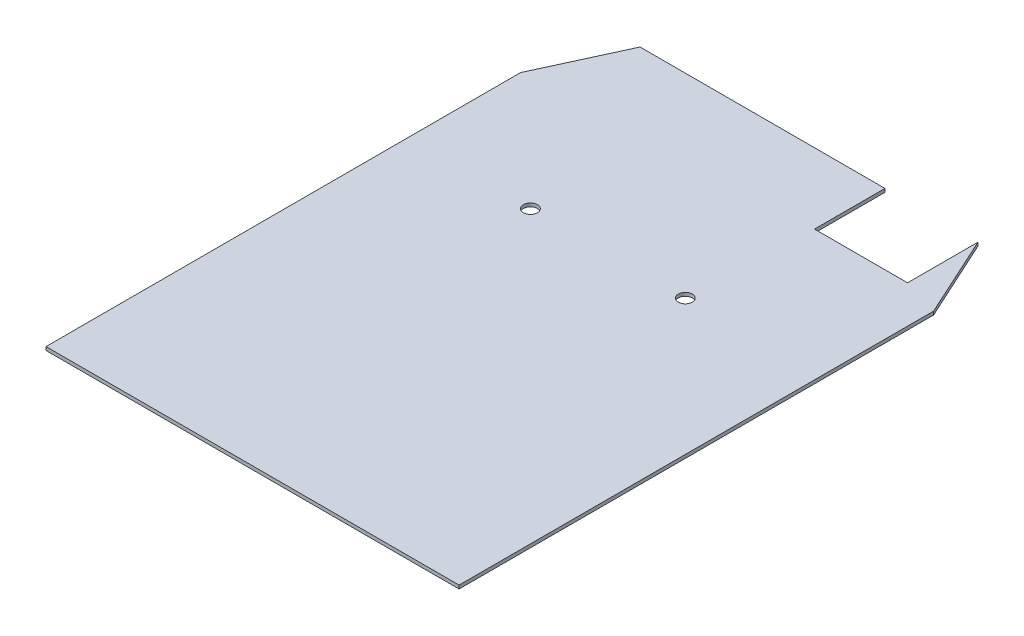
ISO-10303-21;
HEADER;
FILE_DESCRIPTION(('STEP AP214'),'2;1');
FILE_NAME('part.step','',(''),(''),'','','');
FILE_SCHEMA(('AUTOMOTIVE_DESIGN { 1 0 10303 214 1 1 1 1 }'));
ENDSEC;
DATA;
#1=APPLICATION_CONTEXT('core data for automotive mechanical design processes');
#2=APPLICATION_PROTOCOL_DEFINITION('international standard','automotive_design',2000,#1);
#3=PRODUCT_CONTEXT('',#1,'mechanical');
#4=PRODUCT('Part','Part','',(#3));
#5=PRODUCT_RELATED_PRODUCT_CATEGORY('part','',(#4));
#6=PRODUCT_DEFINITION_FORMATION('','',#4);
#7=PRODUCT_DEFINITION_CONTEXT('part definition',#1,'design');
#8=PRODUCT_DEFINITION('design','',#6,#7);
#9=PRODUCT_DEFINITION_SHAPE('','',#8);
#10=(LENGTH_UNIT() NAMED_UNIT(*) SI_UNIT(.MILLI.,.METRE.));
#11=(NAMED_UNIT(*) PLANE_ANGLE_UNIT() SI_UNIT($,.RADIAN.));
#12=(NAMED_UNIT(*) SI_UNIT($,.STERADIAN.) SOLID_ANGLE_UNIT());
#13=UNCERTAINTY_MEASURE_WITH_UNIT(LENGTH_MEASURE(1.E-05),#10,'distance_accuracy_value','');
#14=(GEOMETRIC_REPRESENTATION_CONTEXT(3) GLOBAL_UNCERTAINTY_ASSIGNED_CONTEXT((#13)) GLOBAL_UNIT_ASSIGNED_CONTEXT((#10,
#11,#12)) REPRESENTATION_CONTEXT('',''));
#15=CARTESIAN_POINT('',(0.,0.,0.));
#16=DIRECTION('',(0.,0.,1.));
#17=DIRECTION('',(1.,0.,0.));
#18=AXIS2_PLACEMENT_3D('',#15,#16,#17);
#19=CARTESIAN_POINT('',(35.321875,1.5875,-145.036189144832));
#20=DIRECTION('',(0.,0.,-1.));
#21=DIRECTION('',(-1.,0.,0.));
#22=AXIS2_PLACEMENT_3D('',#19,#20,#21);
#23=PLANE('',#22);
#24=DIRECTION('',(1.,0.,0.));
#25=VECTOR('',#24,1.);
#26=CARTESIAN_POINT('',(35.321875,0.,-145.036189144832));
#27=LINE('',#26,#25);
#28=CARTESIAN_POINT('',(35.321875,0.,-145.036189144832));
#29=VERTEX_POINT('',#28);
#30=CARTESIAN_POINT('',(78.58125,0.,-145.036189144832));
#31=VERTEX_POINT('',#30);
#32=EDGE_CURVE('E158',#29,#31,#27,.T.);
#33=ORIENTED_EDGE('',*,*,#32,.F.);
#34=DIRECTION('',(0.,-1.,0.));
#35=VECTOR('',#34,1.);
#36=CARTESIAN_POINT('',(35.321875,1.5875,-145.036189144832));
#37=LINE('',#36,#35);
#38=CARTESIAN_POINT('',(35.321875,1.5875,-145.036189144832));
#39=VERTEX_POINT('',#38);
#40=EDGE_CURVE('E163',#39,#29,#37,.T.);
#41=ORIENTED_EDGE('',*,*,#40,.F.);
#42=DIRECTION('',(1.,0.,0.));
#43=VECTOR('',#42,1.);
#44=CARTESIAN_POINT('',(35.321875,1.5875,-145.036189144832));
#45=LINE('',#44,#43);
#46=CARTESIAN_POINT('',(78.58125,1.5875,-145.036189144832));
#47=VERTEX_POINT('',#46);
#48=EDGE_CURVE('E144',#39,#47,#45,.T.);
#49=ORIENTED_EDGE('',*,*,#48,.T.);
#50=DIRECTION('',(0.,-1.,0.));
#51=VECTOR('',#50,1.);
#52=CARTESIAN_POINT('',(78.58125,1.5875,-145.036189144832));
#53=LINE('',#52,#51);
#54=EDGE_CURVE('E43',#47,#31,#53,.T.);
#55=ORIENTED_EDGE('',*,*,#54,.T.);
#56=EDGE_LOOP('',(#33,#41,#49,#55));
#57=FACE_BOUND('',#56,.T.);
#58=ADVANCED_FACE('F34',(#57),#23,.T.);
#59=CARTESIAN_POINT('',(35.321875,1.5875,-177.8));
#60=DIRECTION('',(1.,0.,0.));
#61=DIRECTION('',(0.,0.,-1.));
#62=AXIS2_PLACEMENT_3D('',#59,#60,#61);
#63=PLANE('',#62);
#64=DIRECTION('',(0.,0.,1.));
#65=VECTOR('',#64,1.);
#66=CARTESIAN_POINT('',(35.321875,0.,-177.8));
#67=LINE('',#66,#65);
#68=CARTESIAN_POINT('',(35.321875,0.,-177.8));
#69=VERTEX_POINT('',#68);
#70=EDGE_CURVE('E155',#69,#29,#67,.T.);
#71=ORIENTED_EDGE('',*,*,#70,.F.);
#72=DIRECTION('',(0.,-1.,0.));
#73=VECTOR('',#72,1.);
#74=CARTESIAN_POINT('',(35.321875,1.5875,-177.8));
#75=LINE('',#74,#73);
#76=CARTESIAN_POINT('',(35.321875,1.5875,-177.8));
#77=VERTEX_POINT('',#76);
#78=EDGE_CURVE('E38',#77,#69,#75,.T.);
#79=ORIENTED_EDGE('',*,*,#78,.F.);
#80=DIRECTION('',(0.,0.,1.));
#81=VECTOR('',#80,1.);
#82=CARTESIAN_POINT('',(35.321875,1.5875,-177.8));
#83=LINE('',#82,#81);
#84=EDGE_CURVE('E134',#77,#39,#83,.T.);
#85=ORIENTED_EDGE('',*,*,#84,.T.);
#86=ORIENTED_EDGE('',*,*,#40,.T.);
#87=EDGE_LOOP('',(#71,#79,#85,#86));
#88=FACE_BOUND('',#87,.T.);
#89=ADVANCED_FACE('F173',(#88),#63,.T.);
#90=CARTESIAN_POINT('',(0.,0.,0.));
#91=DIRECTION('',(0.,-1.,0.));
#92=DIRECTION('',(0.,0.,-1.));
#93=AXIS2_PLACEMENT_3D('',#90,#91,#92);
#94=PLANE('',#93);
#95=CARTESIAN_POINT('',(33.07715,0.,-87.2045500000002));
#96=DIRECTION('',(0.,-1.,0.));
#97=DIRECTION('',(0.,0.,-1.));
#98=AXIS2_PLACEMENT_3D('',#95,#96,#97);
#99=CIRCLE('',#98,3.2639);
#100=CARTESIAN_POINT('',(33.07715,0.,-90.4684500000002));
#101=VERTEX_POINT('',#100);
#102=EDGE_CURVE('E186',#101,#101,#99,.T.);
#103=ORIENTED_EDGE('',*,*,#102,.F.);
#104=EDGE_LOOP('',(#103));
#105=FACE_BOUND('',#104,.T.);
#106=CARTESIAN_POINT('',(-38.93185,0.,-87.2045500000002));
#107=DIRECTION('',(0.,-1.,0.));
#108=DIRECTION('',(0.,0.,-1.));
#109=AXIS2_PLACEMENT_3D('',#106,#107,#108);
#110=CIRCLE('',#109,3.26389999999999);
#111=CARTESIAN_POINT('',(-38.93185,0.,-90.4684500000001));
#112=VERTEX_POINT('',#111);
#113=EDGE_CURVE('E203',#112,#112,#110,.T.);
#114=ORIENTED_EDGE('',*,*,#113,.F.);
#115=EDGE_LOOP('',(#114));
#116=FACE_BOUND('',#115,.T.);
#117=DIRECTION('',(-1.,0.,0.));
#118=VECTOR('',#117,1.);
#119=CARTESIAN_POINT('',(96.04375,0.,80.9625));
#120=LINE('',#119,#118);
#121=CARTESIAN_POINT('',(96.04375,0.,80.9625));
#122=VERTEX_POINT('',#121);
#123=CARTESIAN_POINT('',(-96.04375,0.,80.9625));
#124=VERTEX_POINT('',#123);
#125=EDGE_CURVE('E117',#122,#124,#120,.T.);
#126=ORIENTED_EDGE('',*,*,#125,.T.);
#127=DIRECTION('',(0.,0.,-1.));
#128=VECTOR('',#127,1.);
#129=CARTESIAN_POINT('',(-96.04375,0.,177.8));
#130=LINE('',#129,#128);
#131=CARTESIAN_POINT('',(-96.04375,0.,-139.7));
#132=VERTEX_POINT('',#131);
#133=EDGE_CURVE('E125',#124,#132,#130,.T.);
#134=ORIENTED_EDGE('',*,*,#133,.T.);
#135=DIRECTION('',(0.416654710493214,0.,-0.909064822894284));
#136=VECTOR('',#135,1.);
#137=CARTESIAN_POINT('',(-78.58125,0.,-177.8));
#138=LINE('',#137,#136);
#139=CARTESIAN_POINT('',(-78.58125,0.,-177.8));
#140=VERTEX_POINT('',#139);
#141=EDGE_CURVE('E176',#132,#140,#138,.T.);
#142=ORIENTED_EDGE('',*,*,#141,.T.);
#143=DIRECTION('',(1.,0.,0.));
#144=VECTOR('',#143,1.);
#145=CARTESIAN_POINT('',(-96.04375,0.,-177.8));
#146=LINE('',#145,#144);
#147=EDGE_CURVE('E153',#140,#69,#146,.T.);
#148=ORIENTED_EDGE('',*,*,#147,.T.);
#149=ORIENTED_EDGE('',*,*,#70,.T.);
#150=ORIENTED_EDGE('',*,*,#32,.T.);
#151=DIRECTION('',(0.,0.,-1.));
#152=VECTOR('',#151,1.);
#153=CARTESIAN_POINT('',(78.58125,0.,-145.036189144832));
#154=LINE('',#153,#152);
#155=CARTESIAN_POINT('',(78.58125,0.,-177.8));
#156=VERTEX_POINT('',#155);
#157=EDGE_CURVE('E137',#31,#156,#154,.T.);
#158=ORIENTED_EDGE('',*,*,#157,.T.);
#159=DIRECTION('',(0.416654710493214,0.,0.909064822894284));
#160=VECTOR('',#159,1.);
#161=CARTESIAN_POINT('',(96.04375,0.,-139.7));
#162=LINE('',#161,#160);
#163=CARTESIAN_POINT('',(96.04375,0.,-139.7));
#164=VERTEX_POINT('',#163);
#165=EDGE_CURVE('E185',#156,#164,#162,.T.);
#166=ORIENTED_EDGE('',*,*,#165,.T.);
#167=DIRECTION('',(0.,0.,-1.));
#168=VECTOR('',#167,1.);
#169=CARTESIAN_POINT('',(96.04375,0.,177.8));
#170=LINE('',#169,#168);
#171=EDGE_CURVE('E132',#122,#164,#170,.T.);
#172=ORIENTED_EDGE('',*,*,#171,.F.);
#173=EDGE_LOOP('',(#126,#134,#142,#148,#149,#150,#158,#166,#172));
#174=FACE_BOUND('',#173,.T.);
#175=ADVANCED_FACE('F175',(#105,#116,#174),#94,.T.);
#176=CARTESIAN_POINT('',(0.,1.5875,0.));
#177=DIRECTION('',(0.,-1.,0.));
#178=DIRECTION('',(0.,0.,-1.));
#179=AXIS2_PLACEMENT_3D('',#176,#177,#178);
#180=PLANE('',#179);
#181=CARTESIAN_POINT('',(33.07715,1.5875,-87.2045500000002));
#182=DIRECTION('',(0.,1.,0.));
#183=DIRECTION('',(0.,0.,1.));
#184=AXIS2_PLACEMENT_3D('',#181,#182,#183);
#185=CIRCLE('',#184,3.2639);
#186=CARTESIAN_POINT('',(33.07715,1.5875,-83.9406500000002));
#187=VERTEX_POINT('',#186);
#188=EDGE_CURVE('E206',#187,#187,#185,.T.);
#189=ORIENTED_EDGE('',*,*,#188,.F.);
#190=EDGE_LOOP('',(#189));
#191=FACE_BOUND('',#190,.T.);
#192=CARTESIAN_POINT('',(-38.93185,1.5875,-87.2045500000002));
#193=DIRECTION('',(0.,1.,0.));
#194=DIRECTION('',(0.,0.,1.));
#195=AXIS2_PLACEMENT_3D('',#192,#193,#194);
#196=CIRCLE('',#195,3.26389999999999);
#197=CARTESIAN_POINT('',(-38.93185,1.5875,-83.9406500000002));
#198=VERTEX_POINT('',#197);
#199=EDGE_CURVE('E207',#198,#198,#196,.T.);
#200=ORIENTED_EDGE('',*,*,#199,.F.);
#201=EDGE_LOOP('',(#200));
#202=FACE_BOUND('',#201,.T.);
#203=DIRECTION('',(0.,0.,-1.));
#204=VECTOR('',#203,1.);
#205=CARTESIAN_POINT('',(-96.04375,1.5875,177.8));
#206=LINE('',#205,#204);
#207=CARTESIAN_POINT('',(-96.04375,1.5875,80.9625));
#208=VERTEX_POINT('',#207);
#209=CARTESIAN_POINT('',(-96.04375,1.5875,-139.7));
#210=VERTEX_POINT('',#209);
#211=EDGE_CURVE('E123',#208,#210,#206,.T.);
#212=ORIENTED_EDGE('',*,*,#211,.F.);
#213=DIRECTION('',(-1.,0.,0.));
#214=VECTOR('',#213,1.);
#215=CARTESIAN_POINT('',(96.04375,1.5875,80.9625));
#216=LINE('',#215,#214);
#217=CARTESIAN_POINT('',(96.04375,1.5875,80.9625));
#218=VERTEX_POINT('',#217);
#219=EDGE_CURVE('E106',#218,#208,#216,.T.);
#220=ORIENTED_EDGE('',*,*,#219,.F.);
#221=DIRECTION('',(0.,0.,-1.));
#222=VECTOR('',#221,1.);
#223=CARTESIAN_POINT('',(96.04375,1.5875,177.8));
#224=LINE('',#223,#222);
#225=CARTESIAN_POINT('',(96.04375,1.5875,-139.7));
#226=VERTEX_POINT('',#225);
#227=EDGE_CURVE('E150',#218,#226,#224,.T.);
#228=ORIENTED_EDGE('',*,*,#227,.T.);
#229=DIRECTION('',(0.416654710493214,0.,0.909064822894284));
#230=VECTOR('',#229,1.);
#231=CARTESIAN_POINT('',(96.04375,1.5875,-139.7));
#232=LINE('',#231,#230);
#233=CARTESIAN_POINT('',(78.58125,1.5875,-177.8));
#234=VERTEX_POINT('',#233);
#235=EDGE_CURVE('E184',#234,#226,#232,.T.);
#236=ORIENTED_EDGE('',*,*,#235,.F.);
#237=DIRECTION('',(0.,0.,-1.));
#238=VECTOR('',#237,1.);
#239=CARTESIAN_POINT('',(78.58125,1.5875,-145.036189144832));
#240=LINE('',#239,#238);
#241=EDGE_CURVE('E147',#47,#234,#240,.T.);
#242=ORIENTED_EDGE('',*,*,#241,.F.);
#243=ORIENTED_EDGE('',*,*,#48,.F.);
#244=ORIENTED_EDGE('',*,*,#84,.F.);
#245=DIRECTION('',(1.,0.,0.));
#246=VECTOR('',#245,1.);
#247=CARTESIAN_POINT('',(-96.04375,1.5875,-177.8));
#248=LINE('',#247,#246);
#249=CARTESIAN_POINT('',(-78.58125,1.5875,-177.8));
#250=VERTEX_POINT('',#249);
#251=EDGE_CURVE('E131',#250,#77,#248,.T.);
#252=ORIENTED_EDGE('',*,*,#251,.F.);
#253=DIRECTION('',(0.416654710493214,0.,-0.909064822894284));
#254=VECTOR('',#253,1.);
#255=CARTESIAN_POINT('',(-78.58125,1.5875,-177.8));
#256=LINE('',#255,#254);
#257=EDGE_CURVE('E130',#210,#250,#256,.T.);
#258=ORIENTED_EDGE('',*,*,#257,.F.);
#259=EDGE_LOOP('',(#212,#220,#228,#236,#242,#243,#244,#252,#258));
#260=FACE_BOUND('',#259,.T.);
#261=ADVANCED_FACE('F128',(#191,#202,#260),#180,.F.);
#262=CARTESIAN_POINT('',(-96.04375,1.5875,177.8));
#263=DIRECTION('',(-1.,0.,0.));
#264=DIRECTION('',(0.,0.,1.));
#265=AXIS2_PLACEMENT_3D('',#262,#263,#264);
#266=PLANE('',#265);
#267=DIRECTION('',(0.,1.,0.));
#268=VECTOR('',#267,1.);
#269=CARTESIAN_POINT('',(-96.04375,-192.742375416643,80.9625));
#270=LINE('',#269,#268);
#271=EDGE_CURVE('E109',#124,#208,#270,.T.);
#272=ORIENTED_EDGE('',*,*,#271,.T.);
#273=ORIENTED_EDGE('',*,*,#211,.T.);
#274=DIRECTION('',(0.,1.,0.));
#275=VECTOR('',#274,1.);
#276=CARTESIAN_POINT('',(-96.04375,-192.742375416643,-139.7));
#277=LINE('',#276,#275);
#278=EDGE_CURVE('E177',#132,#210,#277,.T.);
#279=ORIENTED_EDGE('',*,*,#278,.F.);
#280=ORIENTED_EDGE('',*,*,#133,.F.);
#281=EDGE_LOOP('',(#272,#273,#279,#280));
#282=FACE_BOUND('',#281,.T.);
#283=ADVANCED_FACE('F36',(#282),#266,.T.);
#284=CARTESIAN_POINT('',(-96.04375,1.5875,-177.8));
#285=DIRECTION('',(0.,0.,-1.));
#286=DIRECTION('',(-1.,0.,0.));
#287=AXIS2_PLACEMENT_3D('',#284,#285,#286);
#288=PLANE('',#287);
#289=DIRECTION('',(0.,1.,0.));
#290=VECTOR('',#289,1.);
#291=CARTESIAN_POINT('',(-78.58125,-192.742375416643,-177.8));
#292=LINE('',#291,#290);
#293=EDGE_CURVE('E59',#140,#250,#292,.T.);
#294=ORIENTED_EDGE('',*,*,#293,.T.);
#295=ORIENTED_EDGE('',*,*,#251,.T.);
#296=ORIENTED_EDGE('',*,*,#78,.T.);
#297=ORIENTED_EDGE('',*,*,#147,.F.);
#298=EDGE_LOOP('',(#294,#295,#296,#297));
#299=FACE_BOUND('',#298,.T.);
#300=ADVANCED_FACE('F171',(#299),#288,.T.);
#301=CARTESIAN_POINT('',(78.58125,1.5875,-145.036189144832));
#302=DIRECTION('',(-1.,0.,0.));
#303=DIRECTION('',(0.,0.,1.));
#304=AXIS2_PLACEMENT_3D('',#301,#302,#303);
#305=PLANE('',#304);
#306=ORIENTED_EDGE('',*,*,#157,.F.);
#307=ORIENTED_EDGE('',*,*,#54,.F.);
#308=ORIENTED_EDGE('',*,*,#241,.T.);
#309=DIRECTION('',(0.,-1.,0.));
#310=VECTOR('',#309,1.);
#311=CARTESIAN_POINT('',(78.58125,1.5875,-177.8));
#312=LINE('',#311,#310);
#313=EDGE_CURVE('E11',#234,#156,#312,.T.);
#314=ORIENTED_EDGE('',*,*,#313,.T.);
#315=EDGE_LOOP('',(#306,#307,#308,#314));
#316=FACE_BOUND('',#315,.T.);
#317=ADVANCED_FACE('F196',(#316),#305,.T.);
#318=CARTESIAN_POINT('',(96.04375,1.5875,177.8));
#319=DIRECTION('',(-1.,0.,0.));
#320=DIRECTION('',(0.,0.,1.));
#321=AXIS2_PLACEMENT_3D('',#318,#319,#320);
#322=PLANE('',#321);
#323=ORIENTED_EDGE('',*,*,#227,.F.);
#324=DIRECTION('',(0.,1.,0.));
#325=VECTOR('',#324,1.);
#326=CARTESIAN_POINT('',(96.04375,-192.742375416643,80.9625));
#327=LINE('',#326,#325);
#328=EDGE_CURVE('E112',#122,#218,#327,.T.);
#329=ORIENTED_EDGE('',*,*,#328,.F.);
#330=ORIENTED_EDGE('',*,*,#171,.T.);
#331=DIRECTION('',(0.,1.,0.));
#332=VECTOR('',#331,1.);
#333=CARTESIAN_POINT('',(96.04375,-192.742375416643,-139.7));
#334=LINE('',#333,#332);
#335=EDGE_CURVE('E51',#164,#226,#334,.T.);
#336=ORIENTED_EDGE('',*,*,#335,.T.);
#337=EDGE_LOOP('',(#323,#329,#330,#336));
#338=FACE_BOUND('',#337,.T.);
#339=ADVANCED_FACE('F198',(#338),#322,.F.);
#340=CARTESIAN_POINT('',(96.04375,-192.742375416643,-139.7));
#341=DIRECTION('',(-0.909064822894284,0.,0.416654710493214));
#342=DIRECTION('',(0.416654710493214,0.,0.909064822894284));
#343=AXIS2_PLACEMENT_3D('',#340,#341,#342);
#344=PLANE('',#343);
#345=ORIENTED_EDGE('',*,*,#313,.F.);
#346=ORIENTED_EDGE('',*,*,#235,.T.);
#347=ORIENTED_EDGE('',*,*,#335,.F.);
#348=ORIENTED_EDGE('',*,*,#165,.F.);
#349=EDGE_LOOP('',(#345,#346,#347,#348));
#350=FACE_BOUND('',#349,.T.);
#351=ADVANCED_FACE('F197',(#350),#344,.F.);
#352=CARTESIAN_POINT('',(-78.58125,-192.742375416643,-177.8));
#353=DIRECTION('',(0.909064822894284,0.,0.416654710493214));
#354=DIRECTION('',(0.416654710493214,0.,-0.909064822894284));
#355=AXIS2_PLACEMENT_3D('',#352,#353,#354);
#356=PLANE('',#355);
#357=ORIENTED_EDGE('',*,*,#278,.T.);
#358=ORIENTED_EDGE('',*,*,#257,.T.);
#359=ORIENTED_EDGE('',*,*,#293,.F.);
#360=ORIENTED_EDGE('',*,*,#141,.F.);
#361=EDGE_LOOP('',(#357,#358,#359,#360));
#362=FACE_BOUND('',#361,.T.);
#363=ADVANCED_FACE('F189',(#362),#356,.F.);
#364=CARTESIAN_POINT('',(96.04375,-192.742375416643,80.9625));
#365=DIRECTION('',(0.,0.,-1.));
#366=DIRECTION('',(-1.,0.,0.));
#367=AXIS2_PLACEMENT_3D('',#364,#365,#366);
#368=PLANE('',#367);
#369=ORIENTED_EDGE('',*,*,#328,.T.);
#370=ORIENTED_EDGE('',*,*,#219,.T.);
#371=ORIENTED_EDGE('',*,*,#271,.F.);
#372=ORIENTED_EDGE('',*,*,#125,.F.);
#373=EDGE_LOOP('',(#369,#370,#371,#372));
#374=FACE_BOUND('',#373,.T.);
#375=ADVANCED_FACE('F108',(#374),#368,.F.);
#376=CARTESIAN_POINT('',(-38.93185,-8.3185,-87.2045500000002));
#377=DIRECTION('',(0.,1.,0.));
#378=DIRECTION('',(0.,0.,1.));
#379=AXIS2_PLACEMENT_3D('',#376,#377,#378);
#380=CYLINDRICAL_SURFACE('',#379,3.26389999999999);
#381=ORIENTED_EDGE('',*,*,#113,.T.);
#382=EDGE_LOOP('',(#381));
#383=FACE_BOUND('',#382,.T.);
#384=ORIENTED_EDGE('',*,*,#199,.T.);
#385=EDGE_LOOP('',(#384));
#386=FACE_BOUND('',#385,.T.);
#387=ADVANCED_FACE('F220',(#383,#386),#380,.F.);
#388=CARTESIAN_POINT('',(33.07715,-8.3185,-87.2045500000002));
#389=DIRECTION('',(0.,1.,0.));
#390=DIRECTION('',(0.,0.,1.));
#391=AXIS2_PLACEMENT_3D('',#388,#389,#390);
#392=CYLINDRICAL_SURFACE('',#391,3.2639);
#393=ORIENTED_EDGE('',*,*,#102,.T.);
#394=EDGE_LOOP('',(#393));
#395=FACE_BOUND('',#394,.T.);
#396=ORIENTED_EDGE('',*,*,#188,.T.);
#397=EDGE_LOOP('',(#396));
#398=FACE_BOUND('',#397,.T.);
#399=ADVANCED_FACE('F213',(#395,#398),#392,.F.);
#400=CLOSED_SHELL('',(#58,#89,#175,#261,#283,#300,#317,#339,#351,#363,#375,#387,#399));
#401=MANIFOLD_SOLID_BREP('B2',#400);
#402=ADVANCED_BREP_SHAPE_REPRESENTATION('',(#18,#401),#14);
#403=SHAPE_DEFINITION_REPRESENTATION(#9,#402);
ENDSEC;
END-ISO-10303-21;
